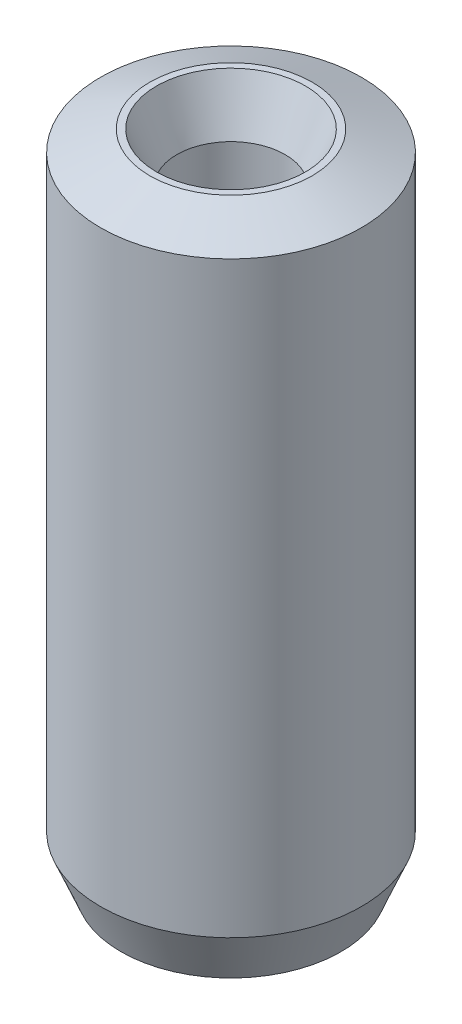
ISO-10303-21;
HEADER;
FILE_DESCRIPTION(('STEP AP214'),'2;1');
FILE_NAME('part.step','',(''),(''),'','','');
FILE_SCHEMA(('AUTOMOTIVE_DESIGN { 1 0 10303 214 1 1 1 1 }'));
ENDSEC;
DATA;
#1=APPLICATION_CONTEXT('core data for automotive mechanical design processes');
#2=APPLICATION_PROTOCOL_DEFINITION('international standard','automotive_design',2000,#1);
#3=PRODUCT_CONTEXT('',#1,'mechanical');
#4=PRODUCT('Part','Part','',(#3));
#5=PRODUCT_RELATED_PRODUCT_CATEGORY('part','',(#4));
#6=PRODUCT_DEFINITION_FORMATION('','',#4);
#7=PRODUCT_DEFINITION_CONTEXT('part definition',#1,'design');
#8=PRODUCT_DEFINITION('design','',#6,#7);
#9=PRODUCT_DEFINITION_SHAPE('','',#8);
#10=(LENGTH_UNIT() NAMED_UNIT(*) SI_UNIT(.MILLI.,.METRE.));
#11=(NAMED_UNIT(*) PLANE_ANGLE_UNIT() SI_UNIT($,.RADIAN.));
#12=(NAMED_UNIT(*) SI_UNIT($,.STERADIAN.) SOLID_ANGLE_UNIT());
#13=UNCERTAINTY_MEASURE_WITH_UNIT(LENGTH_MEASURE(1.E-05),#10,'distance_accuracy_value','');
#14=(GEOMETRIC_REPRESENTATION_CONTEXT(3) GLOBAL_UNCERTAINTY_ASSIGNED_CONTEXT((#13)) GLOBAL_UNIT_ASSIGNED_CONTEXT((#10,
#11,#12)) REPRESENTATION_CONTEXT('',''));
#15=CARTESIAN_POINT('',(0.,0.,0.));
#16=DIRECTION('',(0.,0.,1.));
#17=DIRECTION('',(1.,0.,0.));
#18=AXIS2_PLACEMENT_3D('',#15,#16,#17);
#19=CARTESIAN_POINT('',(0.,75.6177413536645,0.));
#20=DIRECTION('',(0.,-1.,0.));
#21=DIRECTION('',(0.,0.,-1.));
#22=AXIS2_PLACEMENT_3D('',#19,#20,#21);
#23=CYLINDRICAL_SURFACE('',#22,15.);
#24=CARTESIAN_POINT('',(0.,5.66406302456464,0.));
#25=DIRECTION('',(0.,1.,0.));
#26=DIRECTION('',(0.,0.,1.));
#27=AXIS2_PLACEMENT_3D('',#24,#25,#26);
#28=CIRCLE('',#27,15.);
#29=CARTESIAN_POINT('',(0.,5.66406302456464,15.));
#30=VERTEX_POINT('',#29);
#31=EDGE_CURVE('E10',#30,#30,#28,.T.);
#32=ORIENTED_EDGE('',*,*,#31,.T.);
#33=EDGE_LOOP('',(#32));
#34=FACE_BOUND('',#33,.T.);
#35=CARTESIAN_POINT('',(0.,73.2768811483578,0.));
#36=DIRECTION('',(0.,1.,0.));
#37=DIRECTION('',(0.,0.,1.));
#38=AXIS2_PLACEMENT_3D('',#35,#36,#37);
#39=CIRCLE('',#38,15.);
#40=CARTESIAN_POINT('',(0.,73.2768811483578,-15.));
#41=VERTEX_POINT('',#40);
#42=EDGE_CURVE('E50',#41,#41,#39,.F.);
#43=ORIENTED_EDGE('',*,*,#42,.T.);
#44=EDGE_LOOP('',(#43));
#45=FACE_BOUND('',#44,.T.);
#46=ADVANCED_FACE('F39',(#34,#45),#23,.T.);
#47=CARTESIAN_POINT('',(0.,75.6177413536645,0.));
#48=DIRECTION('',(0.,1.,0.));
#49=DIRECTION('',(0.,0.,1.));
#50=AXIS2_PLACEMENT_3D('',#47,#48,#49);
#51=PLANE('',#50);
#52=CARTESIAN_POINT('',(0.,75.6177413536645,0.));
#53=DIRECTION('',(0.,1.,0.));
#54=DIRECTION('',(0.,0.,1.));
#55=AXIS2_PLACEMENT_3D('',#52,#53,#54);
#56=CIRCLE('',#55,8.56896991216041);
#57=CARTESIAN_POINT('',(0.,75.6177413536645,8.56896991216041));
#58=VERTEX_POINT('',#57);
#59=EDGE_CURVE('E58',#58,#58,#56,.F.);
#60=ORIENTED_EDGE('',*,*,#59,.T.);
#61=EDGE_LOOP('',(#60));
#62=FACE_BOUND('',#61,.T.);
#63=CARTESIAN_POINT('',(0.,75.6177413536645,0.));
#64=DIRECTION('',(0.,1.,0.));
#65=DIRECTION('',(0.,0.,1.));
#66=AXIS2_PLACEMENT_3D('',#63,#64,#65);
#67=CIRCLE('',#66,9.33593697543543);
#68=CARTESIAN_POINT('',(0.,75.6177413536645,-9.33593697543544));
#69=VERTEX_POINT('',#68);
#70=EDGE_CURVE('E61',#69,#69,#67,.T.);
#71=ORIENTED_EDGE('',*,*,#70,.T.);
#72=EDGE_LOOP('',(#71));
#73=FACE_BOUND('',#72,.T.);
#74=ADVANCED_FACE('F88',(#62,#73),#51,.T.);
#75=CARTESIAN_POINT('',(0.,0.,0.));
#76=DIRECTION('',(0.,1.,0.));
#77=DIRECTION('',(0.,0.,1.));
#78=AXIS2_PLACEMENT_3D('',#75,#76,#77);
#79=PLANE('',#78);
#80=CARTESIAN_POINT('',(0.,0.,0.));
#81=DIRECTION('',(0.,1.,0.));
#82=DIRECTION('',(0.,0.,1.));
#83=AXIS2_PLACEMENT_3D('',#80,#81,#82);
#84=CIRCLE('',#83,11.8921727314184);
#85=CARTESIAN_POINT('',(0.,0.,-11.8921727314184));
#86=VERTEX_POINT('',#85);
#87=EDGE_CURVE('E51',#86,#86,#84,.T.);
#88=ORIENTED_EDGE('',*,*,#87,.T.);
#89=EDGE_LOOP('',(#88));
#90=FACE_BOUND('',#89,.T.);
#91=CARTESIAN_POINT('',(0.,0.,0.));
#92=DIRECTION('',(0.,1.,0.));
#93=DIRECTION('',(0.,0.,1.));
#94=AXIS2_PLACEMENT_3D('',#91,#92,#93);
#95=CIRCLE('',#94,12.6591397946934);
#96=CARTESIAN_POINT('',(0.,0.,12.6591397946934));
#97=VERTEX_POINT('',#96);
#98=EDGE_CURVE('E54',#97,#97,#95,.F.);
#99=ORIENTED_EDGE('',*,*,#98,.T.);
#100=EDGE_LOOP('',(#99));
#101=FACE_BOUND('',#100,.T.);
#102=ADVANCED_FACE('F83',(#90,#101),#79,.F.);
#103=CARTESIAN_POINT('',(0.,75.6177413536645,0.));
#104=DIRECTION('',(0.,-1.,0.));
#105=DIRECTION('',(0.,0.,-1.));
#106=AXIS2_PLACEMENT_3D('',#103,#104,#105);
#107=CYLINDRICAL_SURFACE('',#106,6.22810970685381);
#108=CARTESIAN_POINT('',(0.,69.9536783290999,0.));
#109=DIRECTION('',(0.,1.,0.));
#110=DIRECTION('',(0.,0.,1.));
#111=AXIS2_PLACEMENT_3D('',#108,#109,#110);
#112=CIRCLE('',#111,6.22810970685381);
#113=CARTESIAN_POINT('',(0.,69.9536783290999,6.22810970685381));
#114=VERTEX_POINT('',#113);
#115=EDGE_CURVE('E67',#114,#114,#112,.T.);
#116=ORIENTED_EDGE('',*,*,#115,.T.);
#117=EDGE_LOOP('',(#116));
#118=FACE_BOUND('',#117,.T.);
#119=CARTESIAN_POINT('',(0.,2.34086020530662,0.));
#120=DIRECTION('',(0.,1.,0.));
#121=DIRECTION('',(0.,0.,1.));
#122=AXIS2_PLACEMENT_3D('',#119,#120,#121);
#123=CIRCLE('',#122,6.22810970685381);
#124=CARTESIAN_POINT('',(0.,2.34086020530662,-6.22810970685381));
#125=VERTEX_POINT('',#124);
#126=EDGE_CURVE('E69',#125,#125,#123,.F.);
#127=ORIENTED_EDGE('',*,*,#126,.T.);
#128=EDGE_LOOP('',(#127));
#129=FACE_BOUND('',#128,.T.);
#130=ADVANCED_FACE('F71',(#118,#129),#107,.F.);
#131=CARTESIAN_POINT('',(0.,69.9536783290999,0.));
#132=DIRECTION('',(0.,1.,0.));
#133=DIRECTION('',(0.,0.,1.));
#134=AXIS2_PLACEMENT_3D('',#131,#132,#133);
#135=CONICAL_SURFACE('',#134,6.22810970685381,0.391904422138115);
#136=ORIENTED_EDGE('',*,*,#59,.F.);
#137=EDGE_LOOP('',(#136));
#138=FACE_BOUND('',#137,.T.);
#139=ORIENTED_EDGE('',*,*,#115,.F.);
#140=EDGE_LOOP('',(#139));
#141=FACE_BOUND('',#140,.T.);
#142=ADVANCED_FACE('F77',(#138,#141),#135,.F.);
#143=CARTESIAN_POINT('',(0.,0.,0.));
#144=DIRECTION('',(0.,-1.,0.));
#145=DIRECTION('',(0.,0.,-1.));
#146=AXIS2_PLACEMENT_3D('',#143,#144,#145);
#147=CONICAL_SURFACE('',#146,11.8921727314184,1.17889190465678);
#148=CARTESIAN_POINT('',(0.,2.34086020530662,-6.22810970685381));
#149=CARTESIAN_POINT('',(0.,2.31647624483467,-6.28711036335969));
#150=CARTESIAN_POINT('',(0.,2.29209228436273,-6.34611101986557));
#151=CARTESIAN_POINT('',(0.,2.24332436341884,-6.46411233287734));
#152=CARTESIAN_POINT('',(0.,2.2189404029469,-6.52311298938322));
#153=CARTESIAN_POINT('',(0.,2.17017248200301,-6.64111430239498));
#154=CARTESIAN_POINT('',(0.,2.14578852153107,-6.70011495890086));
#155=CARTESIAN_POINT('',(0.,2.09702060058718,-6.81811627191262));
#156=CARTESIAN_POINT('',(0.,2.07263664011524,-6.8771169284185));
#157=CARTESIAN_POINT('',(0.,2.02386871917135,-6.99511824143026));
#158=CARTESIAN_POINT('',(0.,1.9994847586994,-7.05411889793614));
#159=CARTESIAN_POINT('',(0.,1.95071683775552,-7.17212021094791));
#160=CARTESIAN_POINT('',(0.,1.92633287728357,-7.23112086745379));
#161=CARTESIAN_POINT('',(0.,1.87756495633968,-7.34912218046555));
#162=CARTESIAN_POINT('',(0.,1.85318099586774,-7.40812283697143));
#163=CARTESIAN_POINT('',(0.,1.80441307492385,-7.52612414998319));
#164=CARTESIAN_POINT('',(0.,1.78002911445191,-7.58512480648907));
#165=CARTESIAN_POINT('',(0.,1.73126119350802,-7.70312611950083));
#166=CARTESIAN_POINT('',(0.,1.70687723303608,-7.76212677600672));
#167=CARTESIAN_POINT('',(0.,1.65810931209219,-7.88012808901848));
#168=CARTESIAN_POINT('',(0.,1.63372535162024,-7.93912874552436));
#169=CARTESIAN_POINT('',(0.,1.58495743067636,-8.05713005853612));
#170=CARTESIAN_POINT('',(0.,1.56057347020441,-8.116130715042));
#171=CARTESIAN_POINT('',(0.,1.51180554926052,-8.23413202805376));
#172=CARTESIAN_POINT('',(0.,1.48742158878858,-8.29313268455964));
#173=CARTESIAN_POINT('',(0.,1.43865366784469,-8.4111339975714));
#174=CARTESIAN_POINT('',(0.,1.41426970737275,-8.47013465407729));
#175=CARTESIAN_POINT('',(0.,1.36550178642886,-8.58813596708905));
#176=CARTESIAN_POINT('',(0.,1.34111782595692,-8.64713662359493));
#177=CARTESIAN_POINT('',(0.,1.29234990501303,-8.76513793660669));
#178=CARTESIAN_POINT('',(0.,1.26796594454109,-8.82413859311257));
#179=CARTESIAN_POINT('',(0.,1.2191980235972,-8.94213990612433));
#180=CARTESIAN_POINT('',(0.,1.19481406312525,-9.00114056263021));
#181=CARTESIAN_POINT('',(0.,1.14604614218137,-9.11914187564197));
#182=CARTESIAN_POINT('',(0.,1.12166218170942,-9.17814253214786));
#183=CARTESIAN_POINT('',(0.,1.07289426076553,-9.29614384515962));
#184=CARTESIAN_POINT('',(0.,1.04851030029359,-9.3551445016655));
#185=CARTESIAN_POINT('',(0.,0.999742379349702,-9.47314581467726));
#186=CARTESIAN_POINT('',(0.,0.975358418877758,-9.53214647118314));
#187=CARTESIAN_POINT('',(0.,0.92659049793387,-9.6501477841949));
#188=CARTESIAN_POINT('',(0.,0.902206537461926,-9.70914844070078));
#189=CARTESIAN_POINT('',(0.,0.853438616518038,-9.82714975371255));
#190=CARTESIAN_POINT('',(0.,0.829054656046094,-9.88615041021843));
#191=CARTESIAN_POINT('',(0.,0.780286735102206,-10.0041517232302));
#192=CARTESIAN_POINT('',(0.,0.755902774630262,-10.0631523797361));
#193=CARTESIAN_POINT('',(0.,0.707134853686374,-10.1811536927478));
#194=CARTESIAN_POINT('',(0.,0.68275089321443,-10.2401543492537));
#195=CARTESIAN_POINT('',(0.,0.633982972270543,-10.3581556622655));
#196=CARTESIAN_POINT('',(0.,0.609599011798599,-10.4171563187714));
#197=CARTESIAN_POINT('',(0.,0.560831090854711,-10.5351576317831));
#198=CARTESIAN_POINT('',(0.,0.536447130382767,-10.594158288289));
#199=CARTESIAN_POINT('',(0.,0.487679209438879,-10.7121596013008));
#200=CARTESIAN_POINT('',(0.,0.463295248966935,-10.7711602578066));
#201=CARTESIAN_POINT('',(0.,0.414527328023047,-10.8891615708184));
#202=CARTESIAN_POINT('',(0.,0.390143367551103,-10.9481622273243));
#203=CARTESIAN_POINT('',(0.,0.341375446607215,-11.066163540336));
#204=CARTESIAN_POINT('',(0.,0.316991486135271,-11.1251641968419));
#205=CARTESIAN_POINT('',(0.,0.268223565191383,-11.2431655098537));
#206=CARTESIAN_POINT('',(0.,0.243839604719439,-11.3021661663596));
#207=CARTESIAN_POINT('',(0.,0.195071683775552,-11.4201674793713));
#208=CARTESIAN_POINT('',(0.,0.170687723303608,-11.4791681358772));
#209=CARTESIAN_POINT('',(0.,0.12191980235972,-11.597169448889));
#210=CARTESIAN_POINT('',(0.,0.0975358418877758,-11.6561701053949));
#211=CARTESIAN_POINT('',(0.,0.0487679209438879,-11.7741714184066));
#212=CARTESIAN_POINT('',(0.,0.024383960471944,-11.8331720749125));
#213=CARTESIAN_POINT('',(0.,0.,-11.8921727314184));
#214=B_SPLINE_CURVE_WITH_KNOTS('',3,(#148,#149,#150,#151,#152,#153,#154,#155,#156,#157,#158,
#159,#160,#161,#162,#163,#164,#165,#166,#167,#168,#169,#170,#171,#172,#173,#174,#175,#176,#177,
#178,#179,#180,#181,#182,#183,#184,#185,#186,#187,#188,#189,#190,#191,#192,#193,#194,#195,#196,
#197,#198,#199,#200,#201,#202,#203,#204,#205,#206,#207,#208,#209,#210,#211,#212,#213),
.UNSPECIFIED.,.F.,.F.,(4,2,2,2,2,2,2,2,2,2,2,2,2,2,2,2,2,2,2,2,2,2,2,2,2,2,2,2,2,2,2,2,4),(0.,
0.19152257038741,0.38304514077482,0.57456771116223,0.766090281549641,0.95761285193705,
1.14913542232446,1.34065799271187,1.53218056309928,1.72370313348669,1.9152257038741,
2.10674827426151,2.29827084464892,2.48979341503633,2.68131598542374,2.87283855581115,
3.06436112619856,3.25588369658597,3.44740626697338,3.63892883736079,3.8304514077482,
4.02197397813561,4.21349654852302,4.40501911891043,4.59654168929784,4.78806425968525,
4.97958683007266,5.17110940046007,5.36263197084748,5.55415454123489,5.7456771116223,
5.93719968200971,6.12872225239712),.UNSPECIFIED.);
#215=EDGE_CURVE('BSEAM73',#125,#86,#214,.T.);
#216=ORIENTED_EDGE('',*,*,#126,.F.);
#217=ORIENTED_EDGE('',*,*,#87,.F.);
#218=ORIENTED_EDGE('',*,*,#215,.T.);
#219=ORIENTED_EDGE('',*,*,#215,.F.);
#220=EDGE_LOOP('',(#216,#218,#217,#219));
#221=FACE_BOUND('',#220,.T.);
#222=ADVANCED_FACE('F73',(#221),#147,.F.);
#223=CARTESIAN_POINT('',(0.,5.66406302456464,0.));
#224=DIRECTION('',(0.,1.,0.));
#225=DIRECTION('',(0.,0.,1.));
#226=AXIS2_PLACEMENT_3D('',#223,#224,#225);
#227=CONICAL_SURFACE('',#226,15.,0.391904422138114);
#228=ORIENTED_EDGE('',*,*,#98,.F.);
#229=EDGE_LOOP('',(#228));
#230=FACE_BOUND('',#229,.T.);
#231=ORIENTED_EDGE('',*,*,#31,.F.);
#232=EDGE_LOOP('',(#231));
#233=FACE_BOUND('',#232,.T.);
#234=ADVANCED_FACE('F76',(#230,#233),#227,.T.);
#235=CARTESIAN_POINT('',(0.,75.6177413536645,0.));
#236=DIRECTION('',(0.,-1.,0.));
#237=DIRECTION('',(0.,0.,-1.));
#238=AXIS2_PLACEMENT_3D('',#235,#236,#237);
#239=CONICAL_SURFACE('',#238,9.33593697543543,1.17889190465678);
#240=CARTESIAN_POINT('',(0.,73.2768811483578,-15.));
#241=CARTESIAN_POINT('',(0.,73.3012651088298,-14.9409993434941));
#242=CARTESIAN_POINT('',(0.,73.3256490693017,-14.8819986869883));
#243=CARTESIAN_POINT('',(0.,73.3744169902456,-14.7639973739765));
#244=CARTESIAN_POINT('',(0.,73.3988009507176,-14.7049967174706));
#245=CARTESIAN_POINT('',(0.,73.4475688716614,-14.5869954044589));
#246=CARTESIAN_POINT('',(0.,73.4719528321334,-14.527994747953));
#247=CARTESIAN_POINT('',(0.,73.5207207530773,-14.4099934349412));
#248=CARTESIAN_POINT('',(0.,73.5451047135492,-14.3509927784353));
#249=CARTESIAN_POINT('',(0.,73.5938726344931,-14.2329914654236));
#250=CARTESIAN_POINT('',(0.,73.6182565949651,-14.1739908089177));
#251=CARTESIAN_POINT('',(0.,73.6670245159089,-14.0559894959059));
#252=CARTESIAN_POINT('',(0.,73.6914084763809,-13.9969888394));
#253=CARTESIAN_POINT('',(0.,73.7401763973248,-13.8789875263883));
#254=CARTESIAN_POINT('',(0.,73.7645603577967,-13.8199868698824));
#255=CARTESIAN_POINT('',(0.,73.8133282787406,-13.7019855568706));
#256=CARTESIAN_POINT('',(0.,73.8377122392126,-13.6429849003648));
#257=CARTESIAN_POINT('',(0.,73.8864801601564,-13.524983587353));
#258=CARTESIAN_POINT('',(0.,73.9108641206284,-13.4659829308471));
#259=CARTESIAN_POINT('',(0.,73.9596320415723,-13.3479816178353));
#260=CARTESIAN_POINT('',(0.,73.9840160020442,-13.2889809613295));
#261=CARTESIAN_POINT('',(0.,74.0327839229881,-13.1709796483177));
#262=CARTESIAN_POINT('',(0.,74.0571678834601,-13.1119789918118));
#263=CARTESIAN_POINT('',(0.,74.1059358044039,-12.9939776788001));
#264=CARTESIAN_POINT('',(0.,74.1303197648759,-12.9349770222942));
#265=CARTESIAN_POINT('',(0.,74.1790876858198,-12.8169757092824));
#266=CARTESIAN_POINT('',(0.,74.2034716462917,-12.7579750527765));
#267=CARTESIAN_POINT('',(0.,74.2522395672356,-12.6399737397648));
#268=CARTESIAN_POINT('',(0.,74.2766235277075,-12.5809730832589));
#269=CARTESIAN_POINT('',(0.,74.3253914486514,-12.4629717702471));
#270=CARTESIAN_POINT('',(0.,74.3497754091234,-12.4039711137413));
#271=CARTESIAN_POINT('',(0.,74.3985433300673,-12.2859698007295));
#272=CARTESIAN_POINT('',(0.,74.4229272905392,-12.2269691442236));
#273=CARTESIAN_POINT('',(0.,74.4716952114831,-12.1089678312119));
#274=CARTESIAN_POINT('',(0.,74.496079171955,-12.049967174706));
#275=CARTESIAN_POINT('',(0.,74.5448470928989,-11.9319658616942));
#276=CARTESIAN_POINT('',(0.,74.5692310533709,-11.8729652051883));
#277=CARTESIAN_POINT('',(0.,74.6179989743147,-11.7549638921766));
#278=CARTESIAN_POINT('',(0.,74.6423829347867,-11.6959632356707));
#279=CARTESIAN_POINT('',(0.,74.6911508557306,-11.5779619226589));
#280=CARTESIAN_POINT('',(0.,74.7155348162025,-11.518961266153));
#281=CARTESIAN_POINT('',(0.,74.7643027371464,-11.4009599531413));
#282=CARTESIAN_POINT('',(0.,74.7886866976184,-11.3419592966354));
#283=CARTESIAN_POINT('',(0.,74.8374546185622,-11.2239579836236));
#284=CARTESIAN_POINT('',(0.,74.8618385790342,-11.1649573271178));
#285=CARTESIAN_POINT('',(0.,74.9106064999781,-11.046956014106));
#286=CARTESIAN_POINT('',(0.,74.93499046045,-10.9879553576001));
#287=CARTESIAN_POINT('',(0.,74.9837583813939,-10.8699540445883));
#288=CARTESIAN_POINT('',(0.,75.0081423418658,-10.8109533880825));
#289=CARTESIAN_POINT('',(0.,75.0569102628097,-10.6929520750707));
#290=CARTESIAN_POINT('',(0.,75.0812942232817,-10.6339514185648));
#291=CARTESIAN_POINT('',(0.,75.1300621442256,-10.5159501055531));
#292=CARTESIAN_POINT('',(0.,75.1544461046975,-10.4569494490472));
#293=CARTESIAN_POINT('',(0.,75.2032140256414,-10.3389481360354));
#294=CARTESIAN_POINT('',(0.,75.2275979861134,-10.2799474795295));
#295=CARTESIAN_POINT('',(0.,75.2763659070572,-10.1619461665178));
#296=CARTESIAN_POINT('',(0.,75.3007498675292,-10.1029455100119));
#297=CARTESIAN_POINT('',(0.,75.3495177884731,-9.98494419700014));
#298=CARTESIAN_POINT('',(0.,75.373901748945,-9.92594354049426));
#299=CARTESIAN_POINT('',(0.,75.4226696698889,-9.80794222748249));
#300=CARTESIAN_POINT('',(0.,75.4470536303608,-9.74894157097661));
#301=CARTESIAN_POINT('',(0.,75.4958215513047,-9.63094025796485));
#302=CARTESIAN_POINT('',(0.,75.5202055117767,-9.57193960145897));
#303=CARTESIAN_POINT('',(0.,75.5689734327206,-9.45393828844721));
#304=CARTESIAN_POINT('',(0.,75.5933573931925,-9.39493763194133));
#305=CARTESIAN_POINT('',(0.,75.6177413536645,-9.33593697543544));
#306=B_SPLINE_CURVE_WITH_KNOTS('',3,(#240,#241,#242,#243,#244,#245,#246,#247,#248,#249,#250,
#251,#252,#253,#254,#255,#256,#257,#258,#259,#260,#261,#262,#263,#264,#265,#266,#267,#268,#269,
#270,#271,#272,#273,#274,#275,#276,#277,#278,#279,#280,#281,#282,#283,#284,#285,#286,#287,#288,
#289,#290,#291,#292,#293,#294,#295,#296,#297,#298,#299,#300,#301,#302,#303,#304,#305),
.UNSPECIFIED.,.F.,.F.,(4,2,2,2,2,2,2,2,2,2,2,2,2,2,2,2,2,2,2,2,2,2,2,2,2,2,2,2,2,2,2,2,4),(0.,
0.191522570387412,0.383045140774824,0.574567711162231,0.766090281549644,0.957612851937056,
1.14913542232446,1.34065799271187,1.53218056309929,1.72370313348669,1.91522570387411,
2.10674827426152,2.29827084464892,2.48979341503634,2.68131598542375,2.87283855581115,
3.06436112619857,3.25588369658598,3.44740626697339,3.6389288373608,3.83045140774821,
4.02197397813562,4.21349654852303,4.40501911891044,4.59654168929785,4.78806425968526,
4.97958683007267,5.17110940046008,5.36263197084749,5.55415454123491,5.74567711162231,
5.93719968200972,6.12872225239714),.UNSPECIFIED.);
#307=EDGE_CURVE('BSEAM45',#41,#69,#306,.T.);
#308=ORIENTED_EDGE('',*,*,#42,.F.);
#309=ORIENTED_EDGE('',*,*,#70,.F.);
#310=ORIENTED_EDGE('',*,*,#307,.T.);
#311=ORIENTED_EDGE('',*,*,#307,.F.);
#312=EDGE_LOOP('',(#308,#310,#309,#311));
#313=FACE_BOUND('',#312,.T.);
#314=ADVANCED_FACE('F45',(#313),#239,.T.);
#315=CLOSED_SHELL('',(#46,#74,#102,#130,#142,#222,#234,#314));
#316=MANIFOLD_SOLID_BREP('B2',#315);
#317=ADVANCED_BREP_SHAPE_REPRESENTATION('',(#18,#316),#14);
#318=SHAPE_DEFINITION_REPRESENTATION(#9,#317);
ENDSEC;
END-ISO-10303-21;
